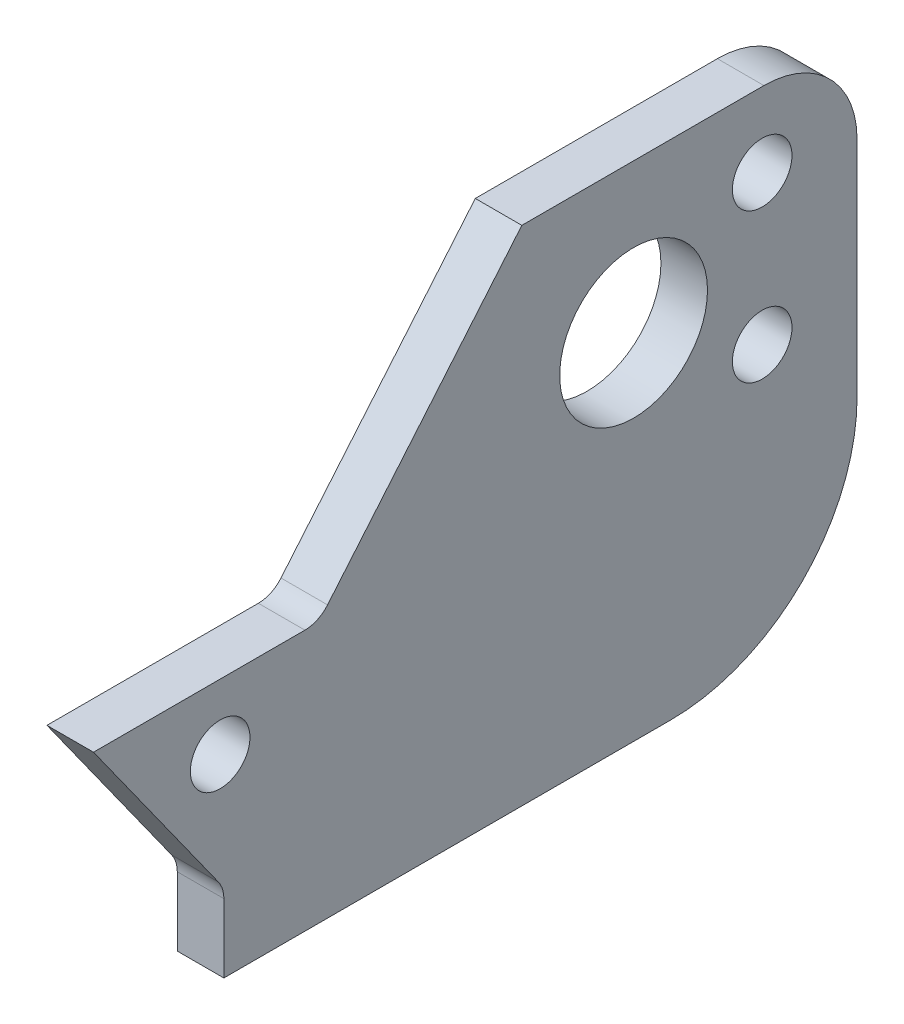
ISO-10303-21;
HEADER;
FILE_DESCRIPTION(('STEP AP214'),'2;1');
FILE_NAME('part.step','',(''),(''),'','','');
FILE_SCHEMA(('AUTOMOTIVE_DESIGN { 1 0 10303 214 1 1 1 1 }'));
ENDSEC;
DATA;
#1=APPLICATION_CONTEXT('core data for automotive mechanical design processes');
#2=APPLICATION_PROTOCOL_DEFINITION('international standard','automotive_design',2000,#1);
#3=PRODUCT_CONTEXT('',#1,'mechanical');
#4=PRODUCT('Part','Part','',(#3));
#5=PRODUCT_RELATED_PRODUCT_CATEGORY('part','',(#4));
#6=PRODUCT_DEFINITION_FORMATION('','',#4);
#7=PRODUCT_DEFINITION_CONTEXT('part definition',#1,'design');
#8=PRODUCT_DEFINITION('design','',#6,#7);
#9=PRODUCT_DEFINITION_SHAPE('','',#8);
#10=(LENGTH_UNIT() NAMED_UNIT(*) SI_UNIT(.MILLI.,.METRE.));
#11=(NAMED_UNIT(*) PLANE_ANGLE_UNIT() SI_UNIT($,.RADIAN.));
#12=(NAMED_UNIT(*) SI_UNIT($,.STERADIAN.) SOLID_ANGLE_UNIT());
#13=UNCERTAINTY_MEASURE_WITH_UNIT(LENGTH_MEASURE(1.E-05),#10,'distance_accuracy_value','');
#14=(GEOMETRIC_REPRESENTATION_CONTEXT(3) GLOBAL_UNCERTAINTY_ASSIGNED_CONTEXT((#13)) GLOBAL_UNIT_ASSIGNED_CONTEXT((#10,
#11,#12)) REPRESENTATION_CONTEXT('',''));
#15=CARTESIAN_POINT('',(0.,0.,0.));
#16=DIRECTION('',(0.,0.,1.));
#17=DIRECTION('',(1.,0.,0.));
#18=AXIS2_PLACEMENT_3D('',#15,#16,#17);
#19=CARTESIAN_POINT('',(9.,6.99999999999999,0.));
#20=DIRECTION('',(0.,1.,0.));
#21=DIRECTION('',(0.,0.,1.));
#22=AXIS2_PLACEMENT_3D('',#19,#20,#21);
#23=PLANE('',#22);
#24=DIRECTION('',(0.,0.,-1.));
#25=VECTOR('',#24,1.);
#26=CARTESIAN_POINT('',(-6.5,6.99999999999999,0.));
#27=LINE('',#26,#25);
#28=CARTESIAN_POINT('',(-6.5,7.,41.));
#29=VERTEX_POINT('',#28);
#30=CARTESIAN_POINT('',(-6.5,6.99999999999999,29.6485586126258));
#31=VERTEX_POINT('',#30);
#32=EDGE_CURVE('E161',#29,#31,#27,.T.);
#33=ORIENTED_EDGE('',*,*,#32,.T.);
#34=DIRECTION('',(-1.,0.,0.));
#35=VECTOR('',#34,1.);
#36=CARTESIAN_POINT('',(9.,6.99999999999999,29.6485586126258));
#37=LINE('',#36,#35);
#38=CARTESIAN_POINT('',(-9.,6.99999999999999,29.6485586126258));
#39=VERTEX_POINT('',#38);
#40=EDGE_CURVE('E235',#31,#39,#37,.T.);
#41=ORIENTED_EDGE('',*,*,#40,.T.);
#42=DIRECTION('',(0.,0.,-1.));
#43=VECTOR('',#42,1.);
#44=CARTESIAN_POINT('',(-9.,6.99999999999999,0.));
#45=LINE('',#44,#43);
#46=CARTESIAN_POINT('',(-9.,7.,41.));
#47=VERTEX_POINT('',#46);
#48=EDGE_CURVE('E164',#47,#39,#45,.T.);
#49=ORIENTED_EDGE('',*,*,#48,.F.);
#50=DIRECTION('',(-1.,0.,0.));
#51=VECTOR('',#50,1.);
#52=CARTESIAN_POINT('',(-6.5,7.,41.));
#53=LINE('',#52,#51);
#54=EDGE_CURVE('E149',#29,#47,#53,.T.);
#55=ORIENTED_EDGE('',*,*,#54,.F.);
#56=EDGE_LOOP('',(#33,#41,#49,#55));
#57=FACE_BOUND('',#56,.T.);
#58=ADVANCED_FACE('F66',(#57),#23,.T.);
#59=CARTESIAN_POINT('',(9.,-6.99999999999999,0.));
#60=DIRECTION('',(0.,1.,0.));
#61=DIRECTION('',(0.,0.,1.));
#62=AXIS2_PLACEMENT_3D('',#59,#60,#61);
#63=PLANE('',#62);
#64=DIRECTION('',(0.,0.,-1.));
#65=VECTOR('',#64,1.);
#66=CARTESIAN_POINT('',(-6.5,-6.99999999999999,0.));
#67=LINE('',#66,#65);
#68=CARTESIAN_POINT('',(-6.5,-7.,34.));
#69=VERTEX_POINT('',#68);
#70=CARTESIAN_POINT('',(-6.5,-7.,10.));
#71=VERTEX_POINT('',#70);
#72=EDGE_CURVE('E290',#69,#71,#67,.T.);
#73=ORIENTED_EDGE('',*,*,#72,.F.);
#74=DIRECTION('',(-1.,0.,0.));
#75=VECTOR('',#74,1.);
#76=CARTESIAN_POINT('',(-6.5,-7.00000000000001,34.));
#77=LINE('',#76,#75);
#78=CARTESIAN_POINT('',(-9.,-7.00000000000001,34.));
#79=VERTEX_POINT('',#78);
#80=EDGE_CURVE('E167',#69,#79,#77,.T.);
#81=ORIENTED_EDGE('',*,*,#80,.T.);
#82=DIRECTION('',(0.,0.,-1.));
#83=VECTOR('',#82,1.);
#84=CARTESIAN_POINT('',(-9.,-6.99999999999999,0.));
#85=LINE('',#84,#83);
#86=CARTESIAN_POINT('',(-9.,-7.,10.));
#87=VERTEX_POINT('',#86);
#88=EDGE_CURVE('E193',#79,#87,#85,.T.);
#89=ORIENTED_EDGE('',*,*,#88,.T.);
#90=DIRECTION('',(-1.,0.,0.));
#91=VECTOR('',#90,1.);
#92=CARTESIAN_POINT('',(-6.5,-7.,10.));
#93=LINE('',#92,#91);
#94=EDGE_CURVE('E228',#87,#71,#93,.F.);
#95=ORIENTED_EDGE('',*,*,#94,.T.);
#96=EDGE_LOOP('',(#73,#81,#89,#95));
#97=FACE_BOUND('',#96,.T.);
#98=ADVANCED_FACE('F371',(#97),#63,.F.);
#99=CARTESIAN_POINT('',(9.,20.,0.));
#100=DIRECTION('',(0.,1.,0.));
#101=DIRECTION('',(0.,0.,1.));
#102=AXIS2_PLACEMENT_3D('',#99,#100,#101);
#103=PLANE('',#102);
#104=DIRECTION('',(0.,0.,-1.));
#105=VECTOR('',#104,1.);
#106=CARTESIAN_POINT('',(-6.5,20.,0.));
#107=LINE('',#106,#105);
#108=CARTESIAN_POINT('',(-6.5,20.,18.));
#109=VERTEX_POINT('',#108);
#110=CARTESIAN_POINT('',(-6.5,20.,5.));
#111=VERTEX_POINT('',#110);
#112=EDGE_CURVE('E184',#109,#111,#107,.T.);
#113=ORIENTED_EDGE('',*,*,#112,.T.);
#114=DIRECTION('',(-1.,0.,0.));
#115=VECTOR('',#114,1.);
#116=CARTESIAN_POINT('',(9.,20.,5.));
#117=LINE('',#116,#115);
#118=CARTESIAN_POINT('',(-9.,20.,5.));
#119=VERTEX_POINT('',#118);
#120=EDGE_CURVE('E207',#111,#119,#117,.T.);
#121=ORIENTED_EDGE('',*,*,#120,.T.);
#122=DIRECTION('',(0.,0.,-1.));
#123=VECTOR('',#122,1.);
#124=CARTESIAN_POINT('',(-9.,20.,0.));
#125=LINE('',#124,#123);
#126=CARTESIAN_POINT('',(-9.,20.,18.));
#127=VERTEX_POINT('',#126);
#128=EDGE_CURVE('E175',#127,#119,#125,.T.);
#129=ORIENTED_EDGE('',*,*,#128,.F.);
#130=DIRECTION('',(-1.,0.,0.));
#131=VECTOR('',#130,1.);
#132=CARTESIAN_POINT('',(9.,20.,18.));
#133=LINE('',#132,#131);
#134=EDGE_CURVE('E200',#109,#127,#133,.T.);
#135=ORIENTED_EDGE('',*,*,#134,.F.);
#136=EDGE_LOOP('',(#113,#121,#129,#135));
#137=FACE_BOUND('',#136,.T.);
#138=ADVANCED_FACE('F389',(#137),#103,.T.);
#139=CARTESIAN_POINT('',(9.,17.1267880004407,20.4109111291244));
#140=DIRECTION('',(0.,-0.642787609686543,-0.766044443118975));
#141=DIRECTION('',(0.,0.766044443118975,-0.642787609686543));
#142=AXIS2_PLACEMENT_3D('',#139,#140,#141);
#143=PLANE('',#142);
#144=DIRECTION('',(0.,-0.766044443118975,0.642787609686543));
#145=VECTOR('',#144,1.);
#146=CARTESIAN_POINT('',(-9.,17.1267880004407,20.4109111291244));
#147=LINE('',#146,#145);
#148=CARTESIAN_POINT('',(-9.,7.5670746696226,28.4324630591744));
#149=VERTEX_POINT('',#148);
#150=EDGE_CURVE('E182',#127,#149,#147,.T.);
#151=ORIENTED_EDGE('',*,*,#150,.T.);
#152=DIRECTION('',(-1.,0.,0.));
#153=VECTOR('',#152,1.);
#154=CARTESIAN_POINT('',(9.,7.5670746696226,28.4324630591744));
#155=LINE('',#154,#153);
#156=CARTESIAN_POINT('',(-6.5,7.5670746696226,28.4324630591744));
#157=VERTEX_POINT('',#156);
#158=EDGE_CURVE('E238',#149,#157,#155,.F.);
#159=ORIENTED_EDGE('',*,*,#158,.T.);
#160=DIRECTION('',(0.,-0.766044443118975,0.642787609686543));
#161=VECTOR('',#160,1.);
#162=CARTESIAN_POINT('',(-6.5,17.1267880004407,20.4109111291244));
#163=LINE('',#162,#161);
#164=EDGE_CURVE('E176',#109,#157,#163,.T.);
#165=ORIENTED_EDGE('',*,*,#164,.F.);
#166=ORIENTED_EDGE('',*,*,#134,.T.);
#167=EDGE_LOOP('',(#151,#159,#165,#166));
#168=FACE_BOUND('',#167,.T.);
#169=ADVANCED_FACE('F393',(#168),#143,.F.);
#170=CARTESIAN_POINT('',(9.,0.,0.));
#171=DIRECTION('',(0.,0.,-1.));
#172=DIRECTION('',(0.,1.,0.));
#173=AXIS2_PLACEMENT_3D('',#170,#171,#172);
#174=PLANE('',#173);
#175=DIRECTION('',(0.,-1.,0.));
#176=VECTOR('',#175,1.);
#177=CARTESIAN_POINT('',(-6.5,0.,0.));
#178=LINE('',#177,#176);
#179=CARTESIAN_POINT('',(-6.5,15.,0.));
#180=VERTEX_POINT('',#179);
#181=CARTESIAN_POINT('',(-6.5,3.,0.));
#182=VERTEX_POINT('',#181);
#183=EDGE_CURVE('E203',#180,#182,#178,.T.);
#184=ORIENTED_EDGE('',*,*,#183,.T.);
#185=DIRECTION('',(-1.,0.,0.));
#186=VECTOR('',#185,1.);
#187=CARTESIAN_POINT('',(-9.,3.,0.));
#188=LINE('',#187,#186);
#189=CARTESIAN_POINT('',(-9.,3.,0.));
#190=VERTEX_POINT('',#189);
#191=EDGE_CURVE('E220',#182,#190,#188,.T.);
#192=ORIENTED_EDGE('',*,*,#191,.T.);
#193=DIRECTION('',(0.,-1.,0.));
#194=VECTOR('',#193,1.);
#195=CARTESIAN_POINT('',(-9.,0.,0.));
#196=LINE('',#195,#194);
#197=CARTESIAN_POINT('',(-9.,15.,0.));
#198=VERTEX_POINT('',#197);
#199=EDGE_CURVE('E196',#198,#190,#196,.T.);
#200=ORIENTED_EDGE('',*,*,#199,.F.);
#201=DIRECTION('',(-1.,0.,0.));
#202=VECTOR('',#201,1.);
#203=CARTESIAN_POINT('',(9.,15.,0.));
#204=LINE('',#203,#202);
#205=EDGE_CURVE('E214',#198,#180,#204,.F.);
#206=ORIENTED_EDGE('',*,*,#205,.T.);
#207=EDGE_LOOP('',(#184,#192,#200,#206));
#208=FACE_BOUND('',#207,.T.);
#209=ADVANCED_FACE('F380',(#208),#174,.T.);
#210=CARTESIAN_POINT('',(-9.,0.,0.));
#211=DIRECTION('',(1.,0.,0.));
#212=DIRECTION('',(0.,0.,-1.));
#213=AXIS2_PLACEMENT_3D('',#210,#211,#212);
#214=PLANE('',#213);
#215=CARTESIAN_POINT('',(-9.,3.5,34.1988373664787));
#216=DIRECTION('',(-1.,0.,0.));
#217=DIRECTION('',(0.,0.,1.));
#218=AXIS2_PLACEMENT_3D('',#215,#216,#217);
#219=CIRCLE('',#218,1.59999999999999);
#220=CARTESIAN_POINT('',(-9.,3.5,35.7988373664787));
#221=VERTEX_POINT('',#220);
#222=EDGE_CURVE('E351',#221,#221,#219,.T.);
#223=ORIENTED_EDGE('',*,*,#222,.F.);
#224=EDGE_LOOP('',(#223));
#225=FACE_BOUND('',#224,.T.);
#226=CARTESIAN_POINT('',(-9.,8.,5.0949004351856));
#227=DIRECTION('',(-1.,0.,0.));
#228=DIRECTION('',(0.,0.,1.));
#229=AXIS2_PLACEMENT_3D('',#226,#227,#228);
#230=CIRCLE('',#229,1.59999999999999);
#231=CARTESIAN_POINT('',(-9.,8.,6.69490043518559));
#232=VERTEX_POINT('',#231);
#233=EDGE_CURVE('E339',#232,#232,#230,.T.);
#234=ORIENTED_EDGE('',*,*,#233,.F.);
#235=EDGE_LOOP('',(#234));
#236=FACE_BOUND('',#235,.T.);
#237=CARTESIAN_POINT('',(-9.,16.,5.0949004351856));
#238=DIRECTION('',(-1.,0.,0.));
#239=DIRECTION('',(0.,0.,1.));
#240=AXIS2_PLACEMENT_3D('',#237,#238,#239);
#241=CIRCLE('',#240,1.59999999999999);
#242=CARTESIAN_POINT('',(-9.,16.,6.69490043518559));
#243=VERTEX_POINT('',#242);
#244=EDGE_CURVE('E327',#243,#243,#241,.T.);
#245=ORIENTED_EDGE('',*,*,#244,.F.);
#246=EDGE_LOOP('',(#245));
#247=FACE_BOUND('',#246,.T.);
#248=CARTESIAN_POINT('',(-9.,12.,12.));
#249=DIRECTION('',(1.,0.,0.));
#250=DIRECTION('',(0.,0.,-1.));
#251=AXIS2_PLACEMENT_3D('',#248,#249,#250);
#252=CIRCLE('',#251,3.96875);
#253=CARTESIAN_POINT('',(-9.,12.,8.03125));
#254=VERTEX_POINT('',#253);
#255=EDGE_CURVE('E294',#254,#254,#252,.T.);
#256=ORIENTED_EDGE('',*,*,#255,.T.);
#257=EDGE_LOOP('',(#256));
#258=FACE_BOUND('',#257,.T.);
#259=DIRECTION('',(0.,-1.,0.));
#260=VECTOR('',#259,1.);
#261=CARTESIAN_POINT('',(-9.,-2.79999999999999,34.));
#262=LINE('',#261,#260);
#263=CARTESIAN_POINT('',(-9.,-3.30873827228603,34.));
#264=VERTEX_POINT('',#263);
#265=EDGE_CURVE('E155',#264,#79,#262,.T.);
#266=ORIENTED_EDGE('',*,*,#265,.F.);
#267=CARTESIAN_POINT('',(-9.,-3.30873827228603,35.5875));
#268=DIRECTION('',(1.,0.,0.));
#269=DIRECTION('',(0.,0.,-1.));
#270=AXIS2_PLACEMENT_3D('',#267,#268,#269);
#271=CIRCLE('',#270,1.5875);
#272=CARTESIAN_POINT('',(-9.,-2.38602263975696,34.2956981144593));
#273=VERTEX_POINT('',#272);
#274=EDGE_CURVE('E75',#264,#273,#271,.T.);
#275=ORIENTED_EDGE('',*,*,#274,.T.);
#276=DIRECTION('',(0.,-0.813733471206735,-0.581238193719097));
#277=VECTOR('',#276,1.);
#278=CARTESIAN_POINT('',(-9.,7.,41.));
#279=LINE('',#278,#277);
#280=EDGE_CURVE('E317',#47,#273,#279,.T.);
#281=ORIENTED_EDGE('',*,*,#280,.F.);
#282=ORIENTED_EDGE('',*,*,#48,.T.);
#283=CARTESIAN_POINT('',(-9.,8.5875,29.6485586126258));
#284=DIRECTION('',(1.,0.,0.));
#285=DIRECTION('',(0.,0.,-1.));
#286=AXIS2_PLACEMENT_3D('',#283,#284,#285);
#287=CIRCLE('',#286,1.5875);
#288=EDGE_CURVE('E247',#39,#149,#287,.T.);
#289=ORIENTED_EDGE('',*,*,#288,.T.);
#290=ORIENTED_EDGE('',*,*,#150,.F.);
#291=ORIENTED_EDGE('',*,*,#128,.T.);
#292=CARTESIAN_POINT('',(-9.,15.,5.));
#293=DIRECTION('',(1.,0.,0.));
#294=DIRECTION('',(0.,0.,-1.));
#295=AXIS2_PLACEMENT_3D('',#292,#293,#294);
#296=CIRCLE('',#295,5.);
#297=EDGE_CURVE('E211',#119,#198,#296,.F.);
#298=ORIENTED_EDGE('',*,*,#297,.T.);
#299=ORIENTED_EDGE('',*,*,#199,.T.);
#300=CARTESIAN_POINT('',(-9.,3.,10.));
#301=DIRECTION('',(1.,0.,0.));
#302=DIRECTION('',(0.,0.,-1.));
#303=AXIS2_PLACEMENT_3D('',#300,#301,#302);
#304=CIRCLE('',#303,10.);
#305=EDGE_CURVE('E224',#190,#87,#304,.F.);
#306=ORIENTED_EDGE('',*,*,#305,.T.);
#307=ORIENTED_EDGE('',*,*,#88,.F.);
#308=EDGE_LOOP('',(#266,#275,#281,#282,#289,#290,#291,#298,#299,#306,#307));
#309=FACE_BOUND('',#308,.T.);
#310=ADVANCED_FACE('F395',(#225,#236,#247,#258,#309),#214,.F.);
#311=CARTESIAN_POINT('',(-6.5,0.,0.));
#312=DIRECTION('',(1.,0.,0.));
#313=DIRECTION('',(0.,0.,-1.));
#314=AXIS2_PLACEMENT_3D('',#311,#312,#313);
#315=PLANE('',#314);
#316=CARTESIAN_POINT('',(-6.5,3.5,34.1988373664787));
#317=DIRECTION('',(1.,0.,0.));
#318=DIRECTION('',(0.,0.,-1.));
#319=AXIS2_PLACEMENT_3D('',#316,#317,#318);
#320=CIRCLE('',#319,1.59999999999999);
#321=CARTESIAN_POINT('',(-6.5,3.5,32.5988373664787));
#322=VERTEX_POINT('',#321);
#323=EDGE_CURVE('E345',#322,#322,#320,.F.);
#324=ORIENTED_EDGE('',*,*,#323,.T.);
#325=EDGE_LOOP('',(#324));
#326=FACE_BOUND('',#325,.T.);
#327=CARTESIAN_POINT('',(-6.5,8.,5.0949004351856));
#328=DIRECTION('',(1.,0.,0.));
#329=DIRECTION('',(0.,0.,-1.));
#330=AXIS2_PLACEMENT_3D('',#327,#328,#329);
#331=CIRCLE('',#330,1.59999999999999);
#332=CARTESIAN_POINT('',(-6.5,8.,3.4949004351856));
#333=VERTEX_POINT('',#332);
#334=EDGE_CURVE('E333',#333,#333,#331,.F.);
#335=ORIENTED_EDGE('',*,*,#334,.T.);
#336=EDGE_LOOP('',(#335));
#337=FACE_BOUND('',#336,.T.);
#338=CARTESIAN_POINT('',(-6.5,16.,5.0949004351856));
#339=DIRECTION('',(1.,0.,0.));
#340=DIRECTION('',(0.,0.,-1.));
#341=AXIS2_PLACEMENT_3D('',#338,#339,#340);
#342=CIRCLE('',#341,1.6);
#343=CARTESIAN_POINT('',(-6.5,16.,3.4949004351856));
#344=VERTEX_POINT('',#343);
#345=EDGE_CURVE('E321',#344,#344,#342,.F.);
#346=ORIENTED_EDGE('',*,*,#345,.T.);
#347=EDGE_LOOP('',(#346));
#348=FACE_BOUND('',#347,.T.);
#349=DIRECTION('',(0.,-0.813733471206735,-0.581238193719097));
#350=VECTOR('',#349,1.);
#351=CARTESIAN_POINT('',(-6.5,7.,41.));
#352=LINE('',#351,#350);
#353=CARTESIAN_POINT('',(-6.5,-2.38602263975696,34.2956981144593));
#354=VERTEX_POINT('',#353);
#355=EDGE_CURVE('E146',#29,#354,#352,.T.);
#356=ORIENTED_EDGE('',*,*,#355,.T.);
#357=CARTESIAN_POINT('',(-6.5,-3.30873827228603,35.5875));
#358=DIRECTION('',(1.,0.,0.));
#359=DIRECTION('',(0.,0.,-1.));
#360=AXIS2_PLACEMENT_3D('',#357,#358,#359);
#361=CIRCLE('',#360,1.5875);
#362=CARTESIAN_POINT('',(-6.5,-3.30873827228603,34.));
#363=VERTEX_POINT('',#362);
#364=EDGE_CURVE('E12',#354,#363,#361,.F.);
#365=ORIENTED_EDGE('',*,*,#364,.T.);
#366=DIRECTION('',(0.,-1.,0.));
#367=VECTOR('',#366,1.);
#368=CARTESIAN_POINT('',(-6.5,-2.79999999999999,34.));
#369=LINE('',#368,#367);
#370=EDGE_CURVE('E154',#363,#69,#369,.T.);
#371=ORIENTED_EDGE('',*,*,#370,.T.);
#372=ORIENTED_EDGE('',*,*,#72,.T.);
#373=CARTESIAN_POINT('',(-6.5,3.,10.));
#374=DIRECTION('',(1.,0.,0.));
#375=DIRECTION('',(0.,0.,-1.));
#376=AXIS2_PLACEMENT_3D('',#373,#374,#375);
#377=CIRCLE('',#376,10.);
#378=EDGE_CURVE('E232',#71,#182,#377,.T.);
#379=ORIENTED_EDGE('',*,*,#378,.T.);
#380=ORIENTED_EDGE('',*,*,#183,.F.);
#381=CARTESIAN_POINT('',(-6.5,15.,5.));
#382=DIRECTION('',(1.,0.,0.));
#383=DIRECTION('',(0.,0.,-1.));
#384=AXIS2_PLACEMENT_3D('',#381,#382,#383);
#385=CIRCLE('',#384,5.);
#386=EDGE_CURVE('E217',#180,#111,#385,.T.);
#387=ORIENTED_EDGE('',*,*,#386,.T.);
#388=ORIENTED_EDGE('',*,*,#112,.F.);
#389=ORIENTED_EDGE('',*,*,#164,.T.);
#390=CARTESIAN_POINT('',(-6.5,8.5875,29.6485586126258));
#391=DIRECTION('',(1.,0.,0.));
#392=DIRECTION('',(0.,0.,-1.));
#393=AXIS2_PLACEMENT_3D('',#390,#391,#392);
#394=CIRCLE('',#393,1.5875);
#395=EDGE_CURVE('E173',#157,#31,#394,.F.);
#396=ORIENTED_EDGE('',*,*,#395,.T.);
#397=ORIENTED_EDGE('',*,*,#32,.F.);
#398=EDGE_LOOP('',(#356,#365,#371,#372,#379,#380,#387,#388,#389,#396,#397));
#399=FACE_BOUND('',#398,.T.);
#400=CARTESIAN_POINT('',(-6.5,12.,12.));
#401=DIRECTION('',(1.,0.,0.));
#402=DIRECTION('',(0.,0.,-1.));
#403=AXIS2_PLACEMENT_3D('',#400,#401,#402);
#404=CIRCLE('',#403,3.96875);
#405=CARTESIAN_POINT('',(-6.5,12.,8.03125));
#406=VERTEX_POINT('',#405);
#407=EDGE_CURVE('E166',#406,#406,#404,.T.);
#408=ORIENTED_EDGE('',*,*,#407,.F.);
#409=EDGE_LOOP('',(#408));
#410=FACE_BOUND('',#409,.T.);
#411=ADVANCED_FACE('F169',(#326,#337,#348,#399,#410),#315,.T.);
#412=CARTESIAN_POINT('',(-12.5,12.,12.));
#413=DIRECTION('',(1.,0.,0.));
#414=DIRECTION('',(0.,0.,-1.));
#415=AXIS2_PLACEMENT_3D('',#412,#413,#414);
#416=CYLINDRICAL_SURFACE('',#415,3.96875);
#417=ORIENTED_EDGE('',*,*,#407,.T.);
#418=EDGE_LOOP('',(#417));
#419=FACE_BOUND('',#418,.T.);
#420=ORIENTED_EDGE('',*,*,#255,.F.);
#421=EDGE_LOOP('',(#420));
#422=FACE_BOUND('',#421,.T.);
#423=ADVANCED_FACE('F423',(#419,#422),#416,.F.);
#424=CARTESIAN_POINT('',(9.,15.,5.));
#425=DIRECTION('',(-1.,0.,0.));
#426=DIRECTION('',(0.,0.,1.));
#427=AXIS2_PLACEMENT_3D('',#424,#425,#426);
#428=CYLINDRICAL_SURFACE('',#427,5.);
#429=ORIENTED_EDGE('',*,*,#386,.F.);
#430=ORIENTED_EDGE('',*,*,#205,.F.);
#431=ORIENTED_EDGE('',*,*,#297,.F.);
#432=ORIENTED_EDGE('',*,*,#120,.F.);
#433=EDGE_LOOP('',(#429,#430,#431,#432));
#434=FACE_BOUND('',#433,.T.);
#435=ADVANCED_FACE('F384',(#434),#428,.T.);
#436=CARTESIAN_POINT('',(9.,3.,10.));
#437=DIRECTION('',(1.,0.,0.));
#438=DIRECTION('',(0.,0.,-1.));
#439=AXIS2_PLACEMENT_3D('',#436,#437,#438);
#440=CYLINDRICAL_SURFACE('',#439,10.);
#441=ORIENTED_EDGE('',*,*,#378,.F.);
#442=ORIENTED_EDGE('',*,*,#94,.F.);
#443=ORIENTED_EDGE('',*,*,#305,.F.);
#444=ORIENTED_EDGE('',*,*,#191,.F.);
#445=EDGE_LOOP('',(#441,#442,#443,#444));
#446=FACE_BOUND('',#445,.T.);
#447=ADVANCED_FACE('F376',(#446),#440,.T.);
#448=CARTESIAN_POINT('',(-6.5,7.,41.));
#449=DIRECTION('',(0.,0.581238193719097,-0.813733471206735));
#450=DIRECTION('',(0.,0.813733471206735,0.581238193719097));
#451=AXIS2_PLACEMENT_3D('',#448,#449,#450);
#452=PLANE('',#451);
#453=ORIENTED_EDGE('',*,*,#280,.T.);
#454=DIRECTION('',(-1.,0.,0.));
#455=VECTOR('',#454,1.);
#456=CARTESIAN_POINT('',(-6.5,-2.38602263975696,34.2956981144593));
#457=LINE('',#456,#455);
#458=EDGE_CURVE('E82',#273,#354,#457,.F.);
#459=ORIENTED_EDGE('',*,*,#458,.T.);
#460=ORIENTED_EDGE('',*,*,#355,.F.);
#461=ORIENTED_EDGE('',*,*,#54,.T.);
#462=EDGE_LOOP('',(#453,#459,#460,#461));
#463=FACE_BOUND('',#462,.T.);
#464=ADVANCED_FACE('F148',(#463),#452,.F.);
#465=CARTESIAN_POINT('',(-6.5,-2.79999999999999,34.));
#466=DIRECTION('',(0.,0.,-1.));
#467=DIRECTION('',(-1.,0.,0.));
#468=AXIS2_PLACEMENT_3D('',#465,#466,#467);
#469=PLANE('',#468);
#470=ORIENTED_EDGE('',*,*,#370,.F.);
#471=DIRECTION('',(-1.,0.,0.));
#472=VECTOR('',#471,1.);
#473=CARTESIAN_POINT('',(-9.,-3.30873827228603,34.));
#474=LINE('',#473,#472);
#475=EDGE_CURVE('E241',#363,#264,#474,.T.);
#476=ORIENTED_EDGE('',*,*,#475,.T.);
#477=ORIENTED_EDGE('',*,*,#265,.T.);
#478=ORIENTED_EDGE('',*,*,#80,.F.);
#479=EDGE_LOOP('',(#470,#476,#477,#478));
#480=FACE_BOUND('',#479,.T.);
#481=ADVANCED_FACE('F368',(#480),#469,.F.);
#482=CARTESIAN_POINT('',(-9.,16.,5.0949004351856));
#483=DIRECTION('',(-1.,0.,0.));
#484=DIRECTION('',(0.,0.,1.));
#485=AXIS2_PLACEMENT_3D('',#482,#483,#484);
#486=CYLINDRICAL_SURFACE('',#485,1.6);
#487=ORIENTED_EDGE('',*,*,#345,.F.);
#488=EDGE_LOOP('',(#487));
#489=FACE_BOUND('',#488,.T.);
#490=ORIENTED_EDGE('',*,*,#244,.T.);
#491=EDGE_LOOP('',(#490));
#492=FACE_BOUND('',#491,.T.);
#493=ADVANCED_FACE('F433',(#489,#492),#486,.F.);
#494=CARTESIAN_POINT('',(-9.,8.,5.0949004351856));
#495=DIRECTION('',(-1.,0.,0.));
#496=DIRECTION('',(0.,0.,1.));
#497=AXIS2_PLACEMENT_3D('',#494,#495,#496);
#498=CYLINDRICAL_SURFACE('',#497,1.59999999999999);
#499=ORIENTED_EDGE('',*,*,#334,.F.);
#500=EDGE_LOOP('',(#499));
#501=FACE_BOUND('',#500,.T.);
#502=ORIENTED_EDGE('',*,*,#233,.T.);
#503=EDGE_LOOP('',(#502));
#504=FACE_BOUND('',#503,.T.);
#505=ADVANCED_FACE('F406',(#501,#504),#498,.F.);
#506=CARTESIAN_POINT('',(-9.,3.5,34.1988373664787));
#507=DIRECTION('',(-1.,0.,0.));
#508=DIRECTION('',(0.,0.,1.));
#509=AXIS2_PLACEMENT_3D('',#506,#507,#508);
#510=CYLINDRICAL_SURFACE('',#509,1.59999999999999);
#511=ORIENTED_EDGE('',*,*,#323,.F.);
#512=EDGE_LOOP('',(#511));
#513=FACE_BOUND('',#512,.T.);
#514=ORIENTED_EDGE('',*,*,#222,.T.);
#515=EDGE_LOOP('',(#514));
#516=FACE_BOUND('',#515,.T.);
#517=ADVANCED_FACE('F399',(#513,#516),#510,.F.);
#518=CARTESIAN_POINT('',(9.,8.5875,29.6485586126258));
#519=DIRECTION('',(-1.,0.,0.));
#520=DIRECTION('',(0.,0.,1.));
#521=AXIS2_PLACEMENT_3D('',#518,#519,#520);
#522=CYLINDRICAL_SURFACE('',#521,1.5875);
#523=ORIENTED_EDGE('',*,*,#395,.F.);
#524=ORIENTED_EDGE('',*,*,#158,.F.);
#525=ORIENTED_EDGE('',*,*,#288,.F.);
#526=ORIENTED_EDGE('',*,*,#40,.F.);
#527=EDGE_LOOP('',(#523,#524,#525,#526));
#528=FACE_BOUND('',#527,.T.);
#529=ADVANCED_FACE('F397',(#528),#522,.F.);
#530=CARTESIAN_POINT('',(-6.5,-3.30873827228603,35.5875));
#531=DIRECTION('',(1.,0.,0.));
#532=DIRECTION('',(0.,0.,-1.));
#533=AXIS2_PLACEMENT_3D('',#530,#531,#532);
#534=CYLINDRICAL_SURFACE('',#533,1.5875);
#535=ORIENTED_EDGE('',*,*,#364,.F.);
#536=ORIENTED_EDGE('',*,*,#458,.F.);
#537=ORIENTED_EDGE('',*,*,#274,.F.);
#538=ORIENTED_EDGE('',*,*,#475,.F.);
#539=EDGE_LOOP('',(#535,#536,#537,#538));
#540=FACE_BOUND('',#539,.T.);
#541=ADVANCED_FACE('F68',(#540),#534,.F.);
#542=CLOSED_SHELL('',(#58,#98,#138,#169,#209,#310,#411,#423,#435,#447,#464,#481,#493,#505,#517,
#529,#541));
#543=MANIFOLD_SOLID_BREP('B2',#542);
#544=ADVANCED_BREP_SHAPE_REPRESENTATION('',(#18,#543),#14);
#545=SHAPE_DEFINITION_REPRESENTATION(#9,#544);
ENDSEC;
END-ISO-10303-21;
